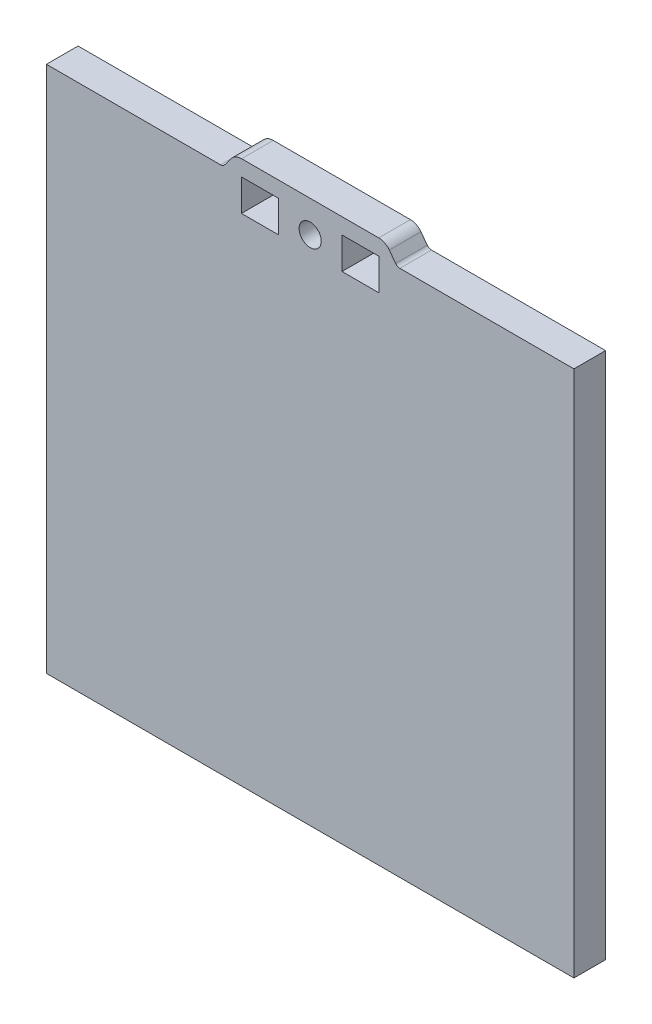
ISO-10303-21;
HEADER;
FILE_DESCRIPTION(('STEP AP214'),'2;1');
FILE_NAME('part.step','',(''),(''),'','','');
FILE_SCHEMA(('AUTOMOTIVE_DESIGN { 1 0 10303 214 1 1 1 1 }'));
ENDSEC;
DATA;
#1=APPLICATION_CONTEXT('core data for automotive mechanical design processes');
#2=APPLICATION_PROTOCOL_DEFINITION('international standard','automotive_design',2000,#1);
#3=PRODUCT_CONTEXT('',#1,'mechanical');
#4=PRODUCT('Part','Part','',(#3));
#5=PRODUCT_RELATED_PRODUCT_CATEGORY('part','',(#4));
#6=PRODUCT_DEFINITION_FORMATION('','',#4);
#7=PRODUCT_DEFINITION_CONTEXT('part definition',#1,'design');
#8=PRODUCT_DEFINITION('design','',#6,#7);
#9=PRODUCT_DEFINITION_SHAPE('','',#8);
#10=(LENGTH_UNIT() NAMED_UNIT(*) SI_UNIT(.MILLI.,.METRE.));
#11=(NAMED_UNIT(*) PLANE_ANGLE_UNIT() SI_UNIT($,.RADIAN.));
#12=(NAMED_UNIT(*) SI_UNIT($,.STERADIAN.) SOLID_ANGLE_UNIT());
#13=UNCERTAINTY_MEASURE_WITH_UNIT(LENGTH_MEASURE(1.E-05),#10,'distance_accuracy_value','');
#14=(GEOMETRIC_REPRESENTATION_CONTEXT(3) GLOBAL_UNCERTAINTY_ASSIGNED_CONTEXT((#13)) GLOBAL_UNIT_ASSIGNED_CONTEXT((#10,
#11,#12)) REPRESENTATION_CONTEXT('',''));
#15=CARTESIAN_POINT('',(0.,0.,0.));
#16=DIRECTION('',(0.,0.,1.));
#17=DIRECTION('',(1.,0.,0.));
#18=AXIS2_PLACEMENT_3D('',#15,#16,#17);
#19=CARTESIAN_POINT('',(-50.,50.,6.));
#20=DIRECTION('',(0.,-1.,0.));
#21=DIRECTION('',(0.,0.,-1.));
#22=AXIS2_PLACEMENT_3D('',#19,#20,#21);
#23=PLANE('',#22);
#24=DIRECTION('',(-1.,0.,0.));
#25=VECTOR('',#24,1.);
#26=CARTESIAN_POINT('',(-50.,50.,6.));
#27=LINE('',#26,#25);
#28=CARTESIAN_POINT('',(-17.,50.,6.));
#29=VERTEX_POINT('',#28);
#30=CARTESIAN_POINT('',(-50.,50.,6.));
#31=VERTEX_POINT('',#30);
#32=EDGE_CURVE('E313',#29,#31,#27,.T.);
#33=ORIENTED_EDGE('',*,*,#32,.F.);
#34=DIRECTION('',(0.,0.,-1.));
#35=VECTOR('',#34,1.);
#36=CARTESIAN_POINT('',(-17.,50.,6.));
#37=LINE('',#36,#35);
#38=CARTESIAN_POINT('',(-17.,50.,0.));
#39=VERTEX_POINT('',#38);
#40=EDGE_CURVE('E303',#29,#39,#37,.T.);
#41=ORIENTED_EDGE('',*,*,#40,.T.);
#42=DIRECTION('',(-1.,0.,0.));
#43=VECTOR('',#42,1.);
#44=CARTESIAN_POINT('',(-50.,50.,0.));
#45=LINE('',#44,#43);
#46=CARTESIAN_POINT('',(-50.,50.,0.));
#47=VERTEX_POINT('',#46);
#48=EDGE_CURVE('E325',#39,#47,#45,.T.);
#49=ORIENTED_EDGE('',*,*,#48,.T.);
#50=DIRECTION('',(0.,0.,-1.));
#51=VECTOR('',#50,1.);
#52=CARTESIAN_POINT('',(-50.,50.,6.));
#53=LINE('',#52,#51);
#54=EDGE_CURVE('E45',#31,#47,#53,.T.);
#55=ORIENTED_EDGE('',*,*,#54,.F.);
#56=EDGE_LOOP('',(#33,#41,#49,#55));
#57=FACE_BOUND('',#56,.T.);
#58=ADVANCED_FACE('F37',(#57),#23,.F.);
#59=CARTESIAN_POINT('',(50.,-50.,6.));
#60=DIRECTION('',(-1.,0.,0.));
#61=DIRECTION('',(0.,0.,1.));
#62=AXIS2_PLACEMENT_3D('',#59,#60,#61);
#63=PLANE('',#62);
#64=DIRECTION('',(0.,1.,0.));
#65=VECTOR('',#64,1.);
#66=CARTESIAN_POINT('',(50.,-50.,0.));
#67=LINE('',#66,#65);
#68=CARTESIAN_POINT('',(50.,-50.,0.));
#69=VERTEX_POINT('',#68);
#70=CARTESIAN_POINT('',(50.,50.,0.));
#71=VERTEX_POINT('',#70);
#72=EDGE_CURVE('E309',#69,#71,#67,.T.);
#73=ORIENTED_EDGE('',*,*,#72,.T.);
#74=DIRECTION('',(0.,0.,-1.));
#75=VECTOR('',#74,1.);
#76=CARTESIAN_POINT('',(50.,50.,6.));
#77=LINE('',#76,#75);
#78=CARTESIAN_POINT('',(50.,50.,6.));
#79=VERTEX_POINT('',#78);
#80=EDGE_CURVE('E11',#79,#71,#77,.T.);
#81=ORIENTED_EDGE('',*,*,#80,.F.);
#82=DIRECTION('',(0.,1.,0.));
#83=VECTOR('',#82,1.);
#84=CARTESIAN_POINT('',(50.,-50.,6.));
#85=LINE('',#84,#83);
#86=CARTESIAN_POINT('',(50.,-50.,6.));
#87=VERTEX_POINT('',#86);
#88=EDGE_CURVE('E310',#87,#79,#85,.T.);
#89=ORIENTED_EDGE('',*,*,#88,.F.);
#90=DIRECTION('',(0.,0.,-1.));
#91=VECTOR('',#90,1.);
#92=CARTESIAN_POINT('',(50.,-50.,6.));
#93=LINE('',#92,#91);
#94=EDGE_CURVE('E322',#87,#69,#93,.T.);
#95=ORIENTED_EDGE('',*,*,#94,.T.);
#96=EDGE_LOOP('',(#73,#81,#89,#95));
#97=FACE_BOUND('',#96,.T.);
#98=ADVANCED_FACE('F39',(#97),#63,.F.);
#99=CARTESIAN_POINT('',(17.,50.,0.));
#100=VERTEX_POINT('',#99);
#101=EDGE_CURVE('E326',#71,#100,#45,.T.);
#102=ORIENTED_EDGE('',*,*,#101,.T.);
#103=DIRECTION('',(0.,0.,-1.));
#104=VECTOR('',#103,1.);
#105=CARTESIAN_POINT('',(17.,50.,6.));
#106=LINE('',#105,#104);
#107=CARTESIAN_POINT('',(17.,50.,6.));
#108=VERTEX_POINT('',#107);
#109=EDGE_CURVE('E300',#108,#100,#106,.T.);
#110=ORIENTED_EDGE('',*,*,#109,.F.);
#111=EDGE_CURVE('E315',#79,#108,#27,.T.);
#112=ORIENTED_EDGE('',*,*,#111,.F.);
#113=ORIENTED_EDGE('',*,*,#80,.T.);
#114=EDGE_LOOP('',(#102,#110,#112,#113));
#115=FACE_BOUND('',#114,.T.);
#116=ADVANCED_FACE('F385',(#115),#23,.F.);
#117=CARTESIAN_POINT('',(-50.,-50.,6.));
#118=DIRECTION('',(1.,0.,0.));
#119=DIRECTION('',(0.,0.,-1.));
#120=AXIS2_PLACEMENT_3D('',#117,#118,#119);
#121=PLANE('',#120);
#122=DIRECTION('',(0.,-1.,0.));
#123=VECTOR('',#122,1.);
#124=CARTESIAN_POINT('',(-50.,-50.,0.));
#125=LINE('',#124,#123);
#126=CARTESIAN_POINT('',(-50.,-50.,0.));
#127=VERTEX_POINT('',#126);
#128=EDGE_CURVE('E328',#47,#127,#125,.T.);
#129=ORIENTED_EDGE('',*,*,#128,.T.);
#130=DIRECTION('',(0.,0.,-1.));
#131=VECTOR('',#130,1.);
#132=CARTESIAN_POINT('',(-50.,-50.,6.));
#133=LINE('',#132,#131);
#134=CARTESIAN_POINT('',(-50.,-50.,6.));
#135=VERTEX_POINT('',#134);
#136=EDGE_CURVE('E333',#135,#127,#133,.T.);
#137=ORIENTED_EDGE('',*,*,#136,.F.);
#138=DIRECTION('',(0.,-1.,0.));
#139=VECTOR('',#138,1.);
#140=CARTESIAN_POINT('',(-50.,-50.,6.));
#141=LINE('',#140,#139);
#142=EDGE_CURVE('E318',#31,#135,#141,.T.);
#143=ORIENTED_EDGE('',*,*,#142,.F.);
#144=ORIENTED_EDGE('',*,*,#54,.T.);
#145=EDGE_LOOP('',(#129,#137,#143,#144));
#146=FACE_BOUND('',#145,.T.);
#147=ADVANCED_FACE('F340',(#146),#121,.F.);
#148=CARTESIAN_POINT('',(-50.,-50.,6.));
#149=DIRECTION('',(0.,1.,0.));
#150=DIRECTION('',(0.,0.,1.));
#151=AXIS2_PLACEMENT_3D('',#148,#149,#150);
#152=PLANE('',#151);
#153=DIRECTION('',(1.,0.,0.));
#154=VECTOR('',#153,1.);
#155=CARTESIAN_POINT('',(-50.,-50.,0.));
#156=LINE('',#155,#154);
#157=EDGE_CURVE('E314',#127,#69,#156,.T.);
#158=ORIENTED_EDGE('',*,*,#157,.T.);
#159=ORIENTED_EDGE('',*,*,#94,.F.);
#160=DIRECTION('',(1.,0.,0.));
#161=VECTOR('',#160,1.);
#162=CARTESIAN_POINT('',(-50.,-50.,6.));
#163=LINE('',#162,#161);
#164=EDGE_CURVE('E320',#135,#87,#163,.T.);
#165=ORIENTED_EDGE('',*,*,#164,.F.);
#166=ORIENTED_EDGE('',*,*,#136,.T.);
#167=EDGE_LOOP('',(#158,#159,#165,#166));
#168=FACE_BOUND('',#167,.T.);
#169=ADVANCED_FACE('F348',(#168),#152,.F.);
#170=CARTESIAN_POINT('',(0.,0.,6.));
#171=DIRECTION('',(0.,0.,-1.));
#172=DIRECTION('',(-1.,0.,0.));
#173=AXIS2_PLACEMENT_3D('',#170,#171,#172);
#174=PLANE('',#173);
#175=DIRECTION('',(-1.,0.,0.));
#176=VECTOR('',#175,1.);
#177=CARTESIAN_POINT('',(13.0318499082157,50.,6.));
#178=LINE('',#177,#176);
#179=CARTESIAN_POINT('',(13.0318499082157,50.,6.));
#180=VERTEX_POINT('',#179);
#181=CARTESIAN_POINT('',(6.03184990821572,50.,6.));
#182=VERTEX_POINT('',#181);
#183=EDGE_CURVE('E204',#180,#182,#178,.T.);
#184=ORIENTED_EDGE('',*,*,#183,.F.);
#185=DIRECTION('',(0.,1.,0.));
#186=VECTOR('',#185,1.);
#187=CARTESIAN_POINT('',(13.0318499082157,50.,6.));
#188=LINE('',#187,#186);
#189=CARTESIAN_POINT('',(13.0318499082157,44.,6.));
#190=VERTEX_POINT('',#189);
#191=EDGE_CURVE('E52',#190,#180,#188,.T.);
#192=ORIENTED_EDGE('',*,*,#191,.F.);
#193=DIRECTION('',(1.,0.,0.));
#194=VECTOR('',#193,1.);
#195=CARTESIAN_POINT('',(13.0318499082157,44.,6.));
#196=LINE('',#195,#194);
#197=CARTESIAN_POINT('',(6.03184990821572,44.,6.));
#198=VERTEX_POINT('',#197);
#199=EDGE_CURVE('E195',#198,#190,#196,.T.);
#200=ORIENTED_EDGE('',*,*,#199,.F.);
#201=DIRECTION('',(0.,-1.,0.));
#202=VECTOR('',#201,1.);
#203=CARTESIAN_POINT('',(6.03184990821572,50.,6.));
#204=LINE('',#203,#202);
#205=EDGE_CURVE('E198',#182,#198,#204,.T.);
#206=ORIENTED_EDGE('',*,*,#205,.F.);
#207=EDGE_LOOP('',(#184,#192,#200,#206));
#208=FACE_BOUND('',#207,.T.);
#209=DIRECTION('',(1.,0.,0.));
#210=VECTOR('',#209,1.);
#211=CARTESIAN_POINT('',(-13.0318499082157,44.,6.));
#212=LINE('',#211,#210);
#213=CARTESIAN_POINT('',(-13.0318499082157,44.,6.));
#214=VERTEX_POINT('',#213);
#215=CARTESIAN_POINT('',(-6.03184990821574,44.,6.));
#216=VERTEX_POINT('',#215);
#217=EDGE_CURVE('E230',#214,#216,#212,.T.);
#218=ORIENTED_EDGE('',*,*,#217,.F.);
#219=DIRECTION('',(0.,-1.,0.));
#220=VECTOR('',#219,1.);
#221=CARTESIAN_POINT('',(-13.0318499082157,50.,6.));
#222=LINE('',#221,#220);
#223=CARTESIAN_POINT('',(-13.0318499082157,50.,6.));
#224=VERTEX_POINT('',#223);
#225=EDGE_CURVE('E60',#224,#214,#222,.T.);
#226=ORIENTED_EDGE('',*,*,#225,.F.);
#227=DIRECTION('',(-1.,0.,0.));
#228=VECTOR('',#227,1.);
#229=CARTESIAN_POINT('',(-13.0318499082157,50.,6.));
#230=LINE('',#229,#228);
#231=CARTESIAN_POINT('',(-6.03184990821574,50.,6.));
#232=VERTEX_POINT('',#231);
#233=EDGE_CURVE('E219',#232,#224,#230,.T.);
#234=ORIENTED_EDGE('',*,*,#233,.F.);
#235=DIRECTION('',(0.,1.,0.));
#236=VECTOR('',#235,1.);
#237=CARTESIAN_POINT('',(-6.03184990821574,50.,6.));
#238=LINE('',#237,#236);
#239=EDGE_CURVE('E234',#216,#232,#238,.T.);
#240=ORIENTED_EDGE('',*,*,#239,.F.);
#241=EDGE_LOOP('',(#218,#226,#234,#240));
#242=FACE_BOUND('',#241,.T.);
#243=CARTESIAN_POINT('',(0.,47.0000000000003,6.));
#244=DIRECTION('',(0.,0.,1.));
#245=DIRECTION('',(1.,0.,0.));
#246=AXIS2_PLACEMENT_3D('',#243,#244,#245);
#247=CIRCLE('',#246,2.1);
#248=CARTESIAN_POINT('',(2.09999999999994,47.0000000000003,6.));
#249=VERTEX_POINT('',#248);
#250=EDGE_CURVE('E247',#249,#249,#247,.T.);
#251=ORIENTED_EDGE('',*,*,#250,.F.);
#252=EDGE_LOOP('',(#251));
#253=FACE_BOUND('',#252,.T.);
#254=ORIENTED_EDGE('',*,*,#88,.T.);
#255=ORIENTED_EDGE('',*,*,#111,.T.);
#256=CARTESIAN_POINT('',(17.,51.,6.));
#257=DIRECTION('',(0.,0.,1.));
#258=DIRECTION('',(1.,0.,0.));
#259=AXIS2_PLACEMENT_3D('',#256,#257,#258);
#260=CIRCLE('',#259,0.999999999999997);
#261=CARTESIAN_POINT('',(16.2,50.4,6.));
#262=VERTEX_POINT('',#261);
#263=EDGE_CURVE('E257',#262,#108,#260,.T.);
#264=ORIENTED_EDGE('',*,*,#263,.F.);
#265=DIRECTION('',(0.6,-0.8,0.));
#266=VECTOR('',#265,1.);
#267=CARTESIAN_POINT('',(34.56,25.92,6.));
#268=LINE('',#267,#266);
#269=CARTESIAN_POINT('',(15.,52.,6.));
#270=VERTEX_POINT('',#269);
#271=EDGE_CURVE('E260',#270,#262,#268,.T.);
#272=ORIENTED_EDGE('',*,*,#271,.F.);
#273=CARTESIAN_POINT('',(13.,50.5,6.));
#274=DIRECTION('',(0.,0.,1.));
#275=DIRECTION('',(1.,0.,0.));
#276=AXIS2_PLACEMENT_3D('',#273,#274,#275);
#277=CIRCLE('',#276,2.49999999999999);
#278=CARTESIAN_POINT('',(13.,53.,6.));
#279=VERTEX_POINT('',#278);
#280=EDGE_CURVE('E263',#279,#270,#277,.F.);
#281=ORIENTED_EDGE('',*,*,#280,.F.);
#282=DIRECTION('',(1.,0.,0.));
#283=VECTOR('',#282,1.);
#284=CARTESIAN_POINT('',(0.,53.,6.));
#285=LINE('',#284,#283);
#286=CARTESIAN_POINT('',(-13.,53.,6.));
#287=VERTEX_POINT('',#286);
#288=EDGE_CURVE('E266',#287,#279,#285,.T.);
#289=ORIENTED_EDGE('',*,*,#288,.F.);
#290=CARTESIAN_POINT('',(-13.,50.5,6.));
#291=DIRECTION('',(0.,0.,1.));
#292=DIRECTION('',(1.,0.,0.));
#293=AXIS2_PLACEMENT_3D('',#290,#291,#292);
#294=CIRCLE('',#293,2.49999999999999);
#295=CARTESIAN_POINT('',(-15.,52.,6.));
#296=VERTEX_POINT('',#295);
#297=EDGE_CURVE('E269',#287,#296,#294,.T.);
#298=ORIENTED_EDGE('',*,*,#297,.T.);
#299=DIRECTION('',(-0.6,-0.8,0.));
#300=VECTOR('',#299,1.);
#301=CARTESIAN_POINT('',(-34.56,25.92,6.));
#302=LINE('',#301,#300);
#303=CARTESIAN_POINT('',(-16.2,50.4,6.));
#304=VERTEX_POINT('',#303);
#305=EDGE_CURVE('E250',#296,#304,#302,.T.);
#306=ORIENTED_EDGE('',*,*,#305,.T.);
#307=CARTESIAN_POINT('',(-17.,51.,6.));
#308=DIRECTION('',(0.,0.,1.));
#309=DIRECTION('',(1.,0.,0.));
#310=AXIS2_PLACEMENT_3D('',#307,#308,#309);
#311=CIRCLE('',#310,0.999999999999997);
#312=EDGE_CURVE('E253',#304,#29,#311,.F.);
#313=ORIENTED_EDGE('',*,*,#312,.T.);
#314=ORIENTED_EDGE('',*,*,#32,.T.);
#315=ORIENTED_EDGE('',*,*,#142,.T.);
#316=ORIENTED_EDGE('',*,*,#164,.T.);
#317=EDGE_LOOP('',(#254,#255,#264,#272,#281,#289,#298,#306,#313,#314,#315,#316));
#318=FACE_BOUND('',#317,.T.);
#319=ADVANCED_FACE('F354',(#208,#242,#253,#318),#174,.F.);
#320=CARTESIAN_POINT('',(0.,0.,0.));
#321=DIRECTION('',(0.,0.,-1.));
#322=DIRECTION('',(-1.,0.,0.));
#323=AXIS2_PLACEMENT_3D('',#320,#321,#322);
#324=PLANE('',#323);
#325=DIRECTION('',(0.,1.,0.));
#326=VECTOR('',#325,1.);
#327=CARTESIAN_POINT('',(13.0318499082157,50.,0.));
#328=LINE('',#327,#326);
#329=CARTESIAN_POINT('',(13.0318499082157,44.,0.));
#330=VERTEX_POINT('',#329);
#331=CARTESIAN_POINT('',(13.0318499082157,50.,0.));
#332=VERTEX_POINT('',#331);
#333=EDGE_CURVE('E176',#330,#332,#328,.T.);
#334=ORIENTED_EDGE('',*,*,#333,.T.);
#335=DIRECTION('',(-1.,0.,0.));
#336=VECTOR('',#335,1.);
#337=CARTESIAN_POINT('',(13.0318499082157,50.,0.));
#338=LINE('',#337,#336);
#339=CARTESIAN_POINT('',(6.03184990821572,50.,0.));
#340=VERTEX_POINT('',#339);
#341=EDGE_CURVE('E186',#332,#340,#338,.T.);
#342=ORIENTED_EDGE('',*,*,#341,.T.);
#343=DIRECTION('',(0.,-1.,0.));
#344=VECTOR('',#343,1.);
#345=CARTESIAN_POINT('',(6.03184990821572,50.,0.));
#346=LINE('',#345,#344);
#347=CARTESIAN_POINT('',(6.03184990821572,44.,0.));
#348=VERTEX_POINT('',#347);
#349=EDGE_CURVE('E190',#340,#348,#346,.T.);
#350=ORIENTED_EDGE('',*,*,#349,.T.);
#351=DIRECTION('',(1.,0.,0.));
#352=VECTOR('',#351,1.);
#353=CARTESIAN_POINT('',(13.0318499082157,44.,0.));
#354=LINE('',#353,#352);
#355=EDGE_CURVE('E182',#348,#330,#354,.T.);
#356=ORIENTED_EDGE('',*,*,#355,.T.);
#357=EDGE_LOOP('',(#334,#342,#350,#356));
#358=FACE_BOUND('',#357,.T.);
#359=DIRECTION('',(0.,-1.,0.));
#360=VECTOR('',#359,1.);
#361=CARTESIAN_POINT('',(-13.0318499082157,50.,0.));
#362=LINE('',#361,#360);
#363=CARTESIAN_POINT('',(-13.0318499082157,50.,0.));
#364=VERTEX_POINT('',#363);
#365=CARTESIAN_POINT('',(-13.0318499082157,44.,0.));
#366=VERTEX_POINT('',#365);
#367=EDGE_CURVE('E215',#364,#366,#362,.T.);
#368=ORIENTED_EDGE('',*,*,#367,.T.);
#369=DIRECTION('',(1.,0.,0.));
#370=VECTOR('',#369,1.);
#371=CARTESIAN_POINT('',(-13.0318499082157,44.,0.));
#372=LINE('',#371,#370);
#373=CARTESIAN_POINT('',(-6.03184990821574,44.,0.));
#374=VERTEX_POINT('',#373);
#375=EDGE_CURVE('E218',#366,#374,#372,.T.);
#376=ORIENTED_EDGE('',*,*,#375,.T.);
#377=DIRECTION('',(0.,1.,0.));
#378=VECTOR('',#377,1.);
#379=CARTESIAN_POINT('',(-6.03184990821574,50.,0.));
#380=LINE('',#379,#378);
#381=CARTESIAN_POINT('',(-6.03184990821574,50.,0.));
#382=VERTEX_POINT('',#381);
#383=EDGE_CURVE('E222',#374,#382,#380,.T.);
#384=ORIENTED_EDGE('',*,*,#383,.T.);
#385=DIRECTION('',(-1.,0.,0.));
#386=VECTOR('',#385,1.);
#387=CARTESIAN_POINT('',(-13.0318499082157,50.,0.));
#388=LINE('',#387,#386);
#389=EDGE_CURVE('E225',#382,#364,#388,.T.);
#390=ORIENTED_EDGE('',*,*,#389,.T.);
#391=EDGE_LOOP('',(#368,#376,#384,#390));
#392=FACE_BOUND('',#391,.T.);
#393=CARTESIAN_POINT('',(0.,47.0000000000003,0.));
#394=DIRECTION('',(0.,0.,1.));
#395=DIRECTION('',(1.,0.,0.));
#396=AXIS2_PLACEMENT_3D('',#393,#394,#395);
#397=CIRCLE('',#396,2.1);
#398=CARTESIAN_POINT('',(2.09999999999994,47.0000000000003,0.));
#399=VERTEX_POINT('',#398);
#400=EDGE_CURVE('E231',#399,#399,#397,.T.);
#401=ORIENTED_EDGE('',*,*,#400,.T.);
#402=EDGE_LOOP('',(#401));
#403=FACE_BOUND('',#402,.T.);
#404=ORIENTED_EDGE('',*,*,#72,.F.);
#405=ORIENTED_EDGE('',*,*,#157,.F.);
#406=ORIENTED_EDGE('',*,*,#128,.F.);
#407=ORIENTED_EDGE('',*,*,#48,.F.);
#408=CARTESIAN_POINT('',(-17.,51.,0.));
#409=DIRECTION('',(0.,0.,1.));
#410=DIRECTION('',(1.,0.,0.));
#411=AXIS2_PLACEMENT_3D('',#408,#409,#410);
#412=CIRCLE('',#411,0.999999999999997);
#413=CARTESIAN_POINT('',(-16.2,50.4,0.));
#414=VERTEX_POINT('',#413);
#415=EDGE_CURVE('E274',#414,#39,#412,.F.);
#416=ORIENTED_EDGE('',*,*,#415,.F.);
#417=DIRECTION('',(-0.6,-0.8,0.));
#418=VECTOR('',#417,1.);
#419=CARTESIAN_POINT('',(-34.56,25.92,0.));
#420=LINE('',#419,#418);
#421=CARTESIAN_POINT('',(-15.,52.,0.));
#422=VERTEX_POINT('',#421);
#423=EDGE_CURVE('E211',#422,#414,#420,.T.);
#424=ORIENTED_EDGE('',*,*,#423,.F.);
#425=CARTESIAN_POINT('',(-13.,50.5,0.));
#426=DIRECTION('',(0.,0.,1.));
#427=DIRECTION('',(1.,0.,0.));
#428=AXIS2_PLACEMENT_3D('',#425,#426,#427);
#429=CIRCLE('',#428,2.49999999999999);
#430=CARTESIAN_POINT('',(-13.,53.,0.));
#431=VERTEX_POINT('',#430);
#432=EDGE_CURVE('E254',#431,#422,#429,.T.);
#433=ORIENTED_EDGE('',*,*,#432,.F.);
#434=DIRECTION('',(1.,0.,0.));
#435=VECTOR('',#434,1.);
#436=CARTESIAN_POINT('',(0.,53.,0.));
#437=LINE('',#436,#435);
#438=CARTESIAN_POINT('',(13.,53.,0.));
#439=VERTEX_POINT('',#438);
#440=EDGE_CURVE('E286',#431,#439,#437,.T.);
#441=ORIENTED_EDGE('',*,*,#440,.T.);
#442=CARTESIAN_POINT('',(13.,50.5,0.));
#443=DIRECTION('',(0.,0.,1.));
#444=DIRECTION('',(1.,0.,0.));
#445=AXIS2_PLACEMENT_3D('',#442,#443,#444);
#446=CIRCLE('',#445,2.49999999999999);
#447=CARTESIAN_POINT('',(15.,52.,0.));
#448=VERTEX_POINT('',#447);
#449=EDGE_CURVE('E283',#439,#448,#446,.F.);
#450=ORIENTED_EDGE('',*,*,#449,.T.);
#451=DIRECTION('',(0.6,-0.8,0.));
#452=VECTOR('',#451,1.);
#453=CARTESIAN_POINT('',(34.56,25.92,0.));
#454=LINE('',#453,#452);
#455=CARTESIAN_POINT('',(16.2,50.4,0.));
#456=VERTEX_POINT('',#455);
#457=EDGE_CURVE('E280',#448,#456,#454,.T.);
#458=ORIENTED_EDGE('',*,*,#457,.T.);
#459=CARTESIAN_POINT('',(17.,51.,0.));
#460=DIRECTION('',(0.,0.,1.));
#461=DIRECTION('',(1.,0.,0.));
#462=AXIS2_PLACEMENT_3D('',#459,#460,#461);
#463=CIRCLE('',#462,0.999999999999997);
#464=EDGE_CURVE('E277',#456,#100,#463,.T.);
#465=ORIENTED_EDGE('',*,*,#464,.T.);
#466=ORIENTED_EDGE('',*,*,#101,.F.);
#467=EDGE_LOOP('',(#404,#405,#406,#407,#416,#424,#433,#441,#450,#458,#465,#466));
#468=FACE_BOUND('',#467,.T.);
#469=ADVANCED_FACE('F192',(#358,#392,#403,#468),#324,.T.);
#470=CARTESIAN_POINT('',(-34.56,25.92,6.));
#471=DIRECTION('',(0.8,-0.6,0.));
#472=DIRECTION('',(0.6,0.8,0.));
#473=AXIS2_PLACEMENT_3D('',#470,#471,#472);
#474=PLANE('',#473);
#475=ORIENTED_EDGE('',*,*,#423,.T.);
#476=DIRECTION('',(0.,0.,-1.));
#477=VECTOR('',#476,1.);
#478=CARTESIAN_POINT('',(-16.2,50.4,6.));
#479=LINE('',#478,#477);
#480=EDGE_CURVE('E306',#304,#414,#479,.T.);
#481=ORIENTED_EDGE('',*,*,#480,.F.);
#482=ORIENTED_EDGE('',*,*,#305,.F.);
#483=DIRECTION('',(0.,0.,-1.));
#484=VECTOR('',#483,1.);
#485=CARTESIAN_POINT('',(-15.,52.,6.));
#486=LINE('',#485,#484);
#487=EDGE_CURVE('E271',#296,#422,#486,.T.);
#488=ORIENTED_EDGE('',*,*,#487,.T.);
#489=EDGE_LOOP('',(#475,#481,#482,#488));
#490=FACE_BOUND('',#489,.T.);
#491=ADVANCED_FACE('F364',(#490),#474,.F.);
#492=CARTESIAN_POINT('',(-17.,51.,6.));
#493=DIRECTION('',(0.,0.,-1.));
#494=DIRECTION('',(-1.,0.,0.));
#495=AXIS2_PLACEMENT_3D('',#492,#493,#494);
#496=CYLINDRICAL_SURFACE('',#495,0.999999999999997);
#497=ORIENTED_EDGE('',*,*,#415,.T.);
#498=ORIENTED_EDGE('',*,*,#40,.F.);
#499=ORIENTED_EDGE('',*,*,#312,.F.);
#500=ORIENTED_EDGE('',*,*,#480,.T.);
#501=EDGE_LOOP('',(#497,#498,#499,#500));
#502=FACE_BOUND('',#501,.T.);
#503=ADVANCED_FACE('F358',(#502),#496,.F.);
#504=CARTESIAN_POINT('',(17.,51.,6.));
#505=DIRECTION('',(0.,0.,-1.));
#506=DIRECTION('',(-1.,0.,0.));
#507=AXIS2_PLACEMENT_3D('',#504,#505,#506);
#508=CYLINDRICAL_SURFACE('',#507,0.999999999999997);
#509=ORIENTED_EDGE('',*,*,#464,.F.);
#510=DIRECTION('',(0.,0.,-1.));
#511=VECTOR('',#510,1.);
#512=CARTESIAN_POINT('',(16.2,50.4,6.));
#513=LINE('',#512,#511);
#514=EDGE_CURVE('E298',#262,#456,#513,.T.);
#515=ORIENTED_EDGE('',*,*,#514,.F.);
#516=ORIENTED_EDGE('',*,*,#263,.T.);
#517=ORIENTED_EDGE('',*,*,#109,.T.);
#518=EDGE_LOOP('',(#509,#515,#516,#517));
#519=FACE_BOUND('',#518,.T.);
#520=ADVANCED_FACE('F383',(#519),#508,.F.);
#521=CARTESIAN_POINT('',(34.56,25.92,6.));
#522=DIRECTION('',(0.8,0.6,0.));
#523=DIRECTION('',(-0.6,0.8,0.));
#524=AXIS2_PLACEMENT_3D('',#521,#522,#523);
#525=PLANE('',#524);
#526=ORIENTED_EDGE('',*,*,#457,.F.);
#527=DIRECTION('',(0.,0.,-1.));
#528=VECTOR('',#527,1.);
#529=CARTESIAN_POINT('',(15.,52.,6.));
#530=LINE('',#529,#528);
#531=EDGE_CURVE('E296',#270,#448,#530,.T.);
#532=ORIENTED_EDGE('',*,*,#531,.F.);
#533=ORIENTED_EDGE('',*,*,#271,.T.);
#534=ORIENTED_EDGE('',*,*,#514,.T.);
#535=EDGE_LOOP('',(#526,#532,#533,#534));
#536=FACE_BOUND('',#535,.T.);
#537=ADVANCED_FACE('F380',(#536),#525,.T.);
#538=CARTESIAN_POINT('',(13.,50.5,6.));
#539=DIRECTION('',(0.,0.,-1.));
#540=DIRECTION('',(-1.,0.,0.));
#541=AXIS2_PLACEMENT_3D('',#538,#539,#540);
#542=CYLINDRICAL_SURFACE('',#541,2.49999999999999);
#543=ORIENTED_EDGE('',*,*,#449,.F.);
#544=DIRECTION('',(0.,0.,-1.));
#545=VECTOR('',#544,1.);
#546=CARTESIAN_POINT('',(13.,53.,6.));
#547=LINE('',#546,#545);
#548=EDGE_CURVE('E294',#279,#439,#547,.T.);
#549=ORIENTED_EDGE('',*,*,#548,.F.);
#550=ORIENTED_EDGE('',*,*,#280,.T.);
#551=ORIENTED_EDGE('',*,*,#531,.T.);
#552=EDGE_LOOP('',(#543,#549,#550,#551));
#553=FACE_BOUND('',#552,.T.);
#554=ADVANCED_FACE('F376',(#553),#542,.T.);
#555=CARTESIAN_POINT('',(0.,53.,6.));
#556=DIRECTION('',(0.,1.,0.));
#557=DIRECTION('',(0.,0.,1.));
#558=AXIS2_PLACEMENT_3D('',#555,#556,#557);
#559=PLANE('',#558);
#560=ORIENTED_EDGE('',*,*,#440,.F.);
#561=DIRECTION('',(0.,0.,-1.));
#562=VECTOR('',#561,1.);
#563=CARTESIAN_POINT('',(-13.,53.,6.));
#564=LINE('',#563,#562);
#565=EDGE_CURVE('E292',#287,#431,#564,.T.);
#566=ORIENTED_EDGE('',*,*,#565,.F.);
#567=ORIENTED_EDGE('',*,*,#288,.T.);
#568=ORIENTED_EDGE('',*,*,#548,.T.);
#569=EDGE_LOOP('',(#560,#566,#567,#568));
#570=FACE_BOUND('',#569,.T.);
#571=ADVANCED_FACE('F372',(#570),#559,.T.);
#572=CARTESIAN_POINT('',(-13.,50.5,6.));
#573=DIRECTION('',(0.,0.,-1.));
#574=DIRECTION('',(-1.,0.,0.));
#575=AXIS2_PLACEMENT_3D('',#572,#573,#574);
#576=CYLINDRICAL_SURFACE('',#575,2.49999999999999);
#577=ORIENTED_EDGE('',*,*,#432,.T.);
#578=ORIENTED_EDGE('',*,*,#487,.F.);
#579=ORIENTED_EDGE('',*,*,#297,.F.);
#580=ORIENTED_EDGE('',*,*,#565,.T.);
#581=EDGE_LOOP('',(#577,#578,#579,#580));
#582=FACE_BOUND('',#581,.T.);
#583=ADVANCED_FACE('F369',(#582),#576,.T.);
#584=CARTESIAN_POINT('',(0.,47.0000000000003,0.));
#585=DIRECTION('',(0.,0.,1.));
#586=DIRECTION('',(1.,0.,0.));
#587=AXIS2_PLACEMENT_3D('',#584,#585,#586);
#588=CYLINDRICAL_SURFACE('',#587,2.1);
#589=ORIENTED_EDGE('',*,*,#400,.F.);
#590=EDGE_LOOP('',(#589));
#591=FACE_BOUND('',#590,.T.);
#592=ORIENTED_EDGE('',*,*,#250,.T.);
#593=EDGE_LOOP('',(#592));
#594=FACE_BOUND('',#593,.T.);
#595=ADVANCED_FACE('F473',(#591,#594),#588,.F.);
#596=CARTESIAN_POINT('',(-13.0318499082157,50.,0.));
#597=DIRECTION('',(-1.,0.,0.));
#598=DIRECTION('',(0.,-1.,0.));
#599=AXIS2_PLACEMENT_3D('',#596,#597,#598);
#600=PLANE('',#599);
#601=ORIENTED_EDGE('',*,*,#225,.T.);
#602=DIRECTION('',(0.,0.,1.));
#603=VECTOR('',#602,1.);
#604=CARTESIAN_POINT('',(-13.0318499082157,44.,0.));
#605=LINE('',#604,#603);
#606=EDGE_CURVE('E228',#366,#214,#605,.T.);
#607=ORIENTED_EDGE('',*,*,#606,.F.);
#608=ORIENTED_EDGE('',*,*,#367,.F.);
#609=DIRECTION('',(0.,0.,1.));
#610=VECTOR('',#609,1.);
#611=CARTESIAN_POINT('',(-13.0318499082157,50.,0.));
#612=LINE('',#611,#610);
#613=EDGE_CURVE('E205',#364,#224,#612,.T.);
#614=ORIENTED_EDGE('',*,*,#613,.T.);
#615=EDGE_LOOP('',(#601,#607,#608,#614));
#616=FACE_BOUND('',#615,.T.);
#617=ADVANCED_FACE('F479',(#616),#600,.F.);
#618=CARTESIAN_POINT('',(-13.0318499082157,50.,0.));
#619=DIRECTION('',(0.,1.,0.));
#620=DIRECTION('',(-1.,0.,0.));
#621=AXIS2_PLACEMENT_3D('',#618,#619,#620);
#622=PLANE('',#621);
#623=ORIENTED_EDGE('',*,*,#233,.T.);
#624=ORIENTED_EDGE('',*,*,#613,.F.);
#625=ORIENTED_EDGE('',*,*,#389,.F.);
#626=DIRECTION('',(0.,0.,1.));
#627=VECTOR('',#626,1.);
#628=CARTESIAN_POINT('',(-6.03184990821574,50.,0.));
#629=LINE('',#628,#627);
#630=EDGE_CURVE('E240',#382,#232,#629,.T.);
#631=ORIENTED_EDGE('',*,*,#630,.T.);
#632=EDGE_LOOP('',(#623,#624,#625,#631));
#633=FACE_BOUND('',#632,.T.);
#634=ADVANCED_FACE('F487',(#633),#622,.F.);
#635=CARTESIAN_POINT('',(-6.03184990821574,50.,0.));
#636=DIRECTION('',(1.,0.,0.));
#637=DIRECTION('',(0.,0.,-1.));
#638=AXIS2_PLACEMENT_3D('',#635,#636,#637);
#639=PLANE('',#638);
#640=ORIENTED_EDGE('',*,*,#239,.T.);
#641=ORIENTED_EDGE('',*,*,#630,.F.);
#642=ORIENTED_EDGE('',*,*,#383,.F.);
#643=DIRECTION('',(0.,0.,1.));
#644=VECTOR('',#643,1.);
#645=CARTESIAN_POINT('',(-6.03184990821574,44.,0.));
#646=LINE('',#645,#644);
#647=EDGE_CURVE('E242',#374,#216,#646,.T.);
#648=ORIENTED_EDGE('',*,*,#647,.T.);
#649=EDGE_LOOP('',(#640,#641,#642,#648));
#650=FACE_BOUND('',#649,.T.);
#651=ADVANCED_FACE('F494',(#650),#639,.F.);
#652=CARTESIAN_POINT('',(-13.0318499082157,44.,0.));
#653=DIRECTION('',(0.,-1.,0.));
#654=DIRECTION('',(0.,0.,-1.));
#655=AXIS2_PLACEMENT_3D('',#652,#653,#654);
#656=PLANE('',#655);
#657=ORIENTED_EDGE('',*,*,#217,.T.);
#658=ORIENTED_EDGE('',*,*,#647,.F.);
#659=ORIENTED_EDGE('',*,*,#375,.F.);
#660=ORIENTED_EDGE('',*,*,#606,.T.);
#661=EDGE_LOOP('',(#657,#658,#659,#660));
#662=FACE_BOUND('',#661,.T.);
#663=ADVANCED_FACE('F502',(#662),#656,.F.);
#664=CARTESIAN_POINT('',(13.0318499082157,50.,0.));
#665=DIRECTION('',(1.,0.,0.));
#666=DIRECTION('',(0.,1.,0.));
#667=AXIS2_PLACEMENT_3D('',#664,#665,#666);
#668=PLANE('',#667);
#669=ORIENTED_EDGE('',*,*,#191,.T.);
#670=DIRECTION('',(0.,0.,1.));
#671=VECTOR('',#670,1.);
#672=CARTESIAN_POINT('',(13.0318499082157,50.,0.));
#673=LINE('',#672,#671);
#674=EDGE_CURVE('E172',#332,#180,#673,.T.);
#675=ORIENTED_EDGE('',*,*,#674,.F.);
#676=ORIENTED_EDGE('',*,*,#333,.F.);
#677=DIRECTION('',(0.,0.,1.));
#678=VECTOR('',#677,1.);
#679=CARTESIAN_POINT('',(13.0318499082157,44.,0.));
#680=LINE('',#679,#678);
#681=EDGE_CURVE('E209',#330,#190,#680,.T.);
#682=ORIENTED_EDGE('',*,*,#681,.T.);
#683=EDGE_LOOP('',(#669,#675,#676,#682));
#684=FACE_BOUND('',#683,.T.);
#685=ADVANCED_FACE('F174',(#684),#668,.F.);
#686=CARTESIAN_POINT('',(13.0318499082157,44.,0.));
#687=DIRECTION('',(0.,-1.,0.));
#688=DIRECTION('',(0.,0.,-1.));
#689=AXIS2_PLACEMENT_3D('',#686,#687,#688);
#690=PLANE('',#689);
#691=ORIENTED_EDGE('',*,*,#199,.T.);
#692=ORIENTED_EDGE('',*,*,#681,.F.);
#693=ORIENTED_EDGE('',*,*,#355,.F.);
#694=DIRECTION('',(0.,0.,1.));
#695=VECTOR('',#694,1.);
#696=CARTESIAN_POINT('',(6.03184990821572,44.,0.));
#697=LINE('',#696,#695);
#698=EDGE_CURVE('E212',#348,#198,#697,.T.);
#699=ORIENTED_EDGE('',*,*,#698,.T.);
#700=EDGE_LOOP('',(#691,#692,#693,#699));
#701=FACE_BOUND('',#700,.T.);
#702=ADVANCED_FACE('F517',(#701),#690,.F.);
#703=CARTESIAN_POINT('',(6.03184990821572,50.,0.));
#704=DIRECTION('',(-1.,0.,0.));
#705=DIRECTION('',(0.,0.,1.));
#706=AXIS2_PLACEMENT_3D('',#703,#704,#705);
#707=PLANE('',#706);
#708=ORIENTED_EDGE('',*,*,#205,.T.);
#709=ORIENTED_EDGE('',*,*,#698,.F.);
#710=ORIENTED_EDGE('',*,*,#349,.F.);
#711=DIRECTION('',(0.,0.,1.));
#712=VECTOR('',#711,1.);
#713=CARTESIAN_POINT('',(6.03184990821572,50.,0.));
#714=LINE('',#713,#712);
#715=EDGE_CURVE('E181',#340,#182,#714,.T.);
#716=ORIENTED_EDGE('',*,*,#715,.T.);
#717=EDGE_LOOP('',(#708,#709,#710,#716));
#718=FACE_BOUND('',#717,.T.);
#719=ADVANCED_FACE('F524',(#718),#707,.F.);
#720=CARTESIAN_POINT('',(13.0318499082157,50.,0.));
#721=DIRECTION('',(0.,1.,0.));
#722=DIRECTION('',(-1.,0.,0.));
#723=AXIS2_PLACEMENT_3D('',#720,#721,#722);
#724=PLANE('',#723);
#725=ORIENTED_EDGE('',*,*,#183,.T.);
#726=ORIENTED_EDGE('',*,*,#715,.F.);
#727=ORIENTED_EDGE('',*,*,#341,.F.);
#728=ORIENTED_EDGE('',*,*,#674,.T.);
#729=EDGE_LOOP('',(#725,#726,#727,#728));
#730=FACE_BOUND('',#729,.T.);
#731=ADVANCED_FACE('F187',(#730),#724,.F.);
#732=CLOSED_SHELL('',(#58,#98,#116,#147,#169,#319,#469,#491,#503,#520,#537,#554,#571,#583,#595,
#617,#634,#651,#663,#685,#702,#719,#731));
#733=MANIFOLD_SOLID_BREP('B2',#732);
#734=ADVANCED_BREP_SHAPE_REPRESENTATION('',(#18,#733),#14);
#735=SHAPE_DEFINITION_REPRESENTATION(#9,#734);
ENDSEC;
END-ISO-10303-21;
